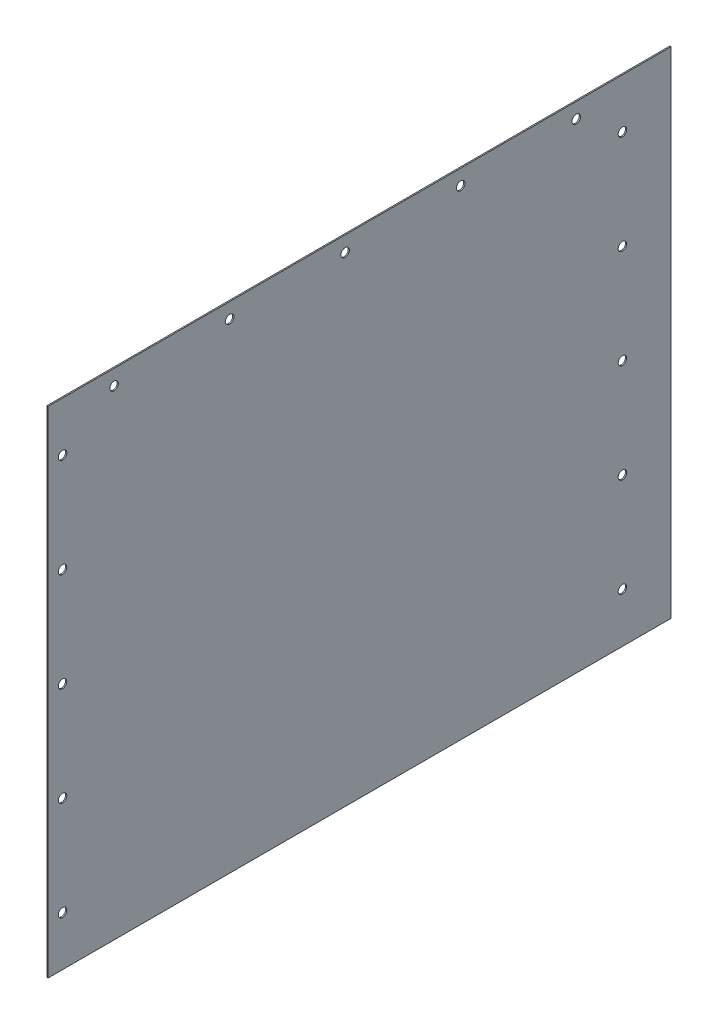
ISO-10303-21;
HEADER;
FILE_DESCRIPTION(('STEP AP214'),'2;1');
FILE_NAME('part.step','',(''),(''),'','','');
FILE_SCHEMA(('AUTOMOTIVE_DESIGN { 1 0 10303 214 1 1 1 1 }'));
ENDSEC;
DATA;
#1=APPLICATION_CONTEXT('core data for automotive mechanical design processes');
#2=APPLICATION_PROTOCOL_DEFINITION('international standard','automotive_design',2000,#1);
#3=PRODUCT_CONTEXT('',#1,'mechanical');
#4=PRODUCT('Part','Part','',(#3));
#5=PRODUCT_RELATED_PRODUCT_CATEGORY('part','',(#4));
#6=PRODUCT_DEFINITION_FORMATION('','',#4);
#7=PRODUCT_DEFINITION_CONTEXT('part definition',#1,'design');
#8=PRODUCT_DEFINITION('design','',#6,#7);
#9=PRODUCT_DEFINITION_SHAPE('','',#8);
#10=(LENGTH_UNIT() NAMED_UNIT(*) SI_UNIT(.MILLI.,.METRE.));
#11=(NAMED_UNIT(*) PLANE_ANGLE_UNIT() SI_UNIT($,.RADIAN.));
#12=(NAMED_UNIT(*) SI_UNIT($,.STERADIAN.) SOLID_ANGLE_UNIT());
#13=UNCERTAINTY_MEASURE_WITH_UNIT(LENGTH_MEASURE(1.E-05),#10,'distance_accuracy_value','');
#14=(GEOMETRIC_REPRESENTATION_CONTEXT(3) GLOBAL_UNCERTAINTY_ASSIGNED_CONTEXT((#13)) GLOBAL_UNIT_ASSIGNED_CONTEXT((#10,
#11,#12)) REPRESENTATION_CONTEXT('',''));
#15=CARTESIAN_POINT('',(0.,0.,0.));
#16=DIRECTION('',(0.,0.,1.));
#17=DIRECTION('',(1.,0.,0.));
#18=AXIS2_PLACEMENT_3D('',#15,#16,#17);
#19=CARTESIAN_POINT('',(0.9144,-190.5,-239.6998));
#20=DIRECTION('',(0.,0.,1.));
#21=DIRECTION('',(1.,0.,0.));
#22=AXIS2_PLACEMENT_3D('',#19,#20,#21);
#23=PLANE('',#22);
#24=DIRECTION('',(0.,1.,0.));
#25=VECTOR('',#24,1.);
#26=CARTESIAN_POINT('',(0.,-190.5,-239.6998));
#27=LINE('',#26,#25);
#28=CARTESIAN_POINT('',(0.,-190.5,-239.6998));
#29=VERTEX_POINT('',#28);
#30=CARTESIAN_POINT('',(0.,190.5,-239.6998));
#31=VERTEX_POINT('',#30);
#32=EDGE_CURVE('E100',#29,#31,#27,.T.);
#33=ORIENTED_EDGE('',*,*,#32,.T.);
#34=DIRECTION('',(-1.,0.,0.));
#35=VECTOR('',#34,1.);
#36=CARTESIAN_POINT('',(0.9144,190.5,-239.6998));
#37=LINE('',#36,#35);
#38=CARTESIAN_POINT('',(0.9144,190.5,-239.6998));
#39=VERTEX_POINT('',#38);
#40=EDGE_CURVE('E11',#39,#31,#37,.T.);
#41=ORIENTED_EDGE('',*,*,#40,.F.);
#42=DIRECTION('',(0.,1.,0.));
#43=VECTOR('',#42,1.);
#44=CARTESIAN_POINT('',(0.9144,-190.5,-239.6998));
#45=LINE('',#44,#43);
#46=CARTESIAN_POINT('',(0.9144,-190.5,-239.6998));
#47=VERTEX_POINT('',#46);
#48=EDGE_CURVE('E87',#47,#39,#45,.T.);
#49=ORIENTED_EDGE('',*,*,#48,.F.);
#50=DIRECTION('',(-1.,0.,0.));
#51=VECTOR('',#50,1.);
#52=CARTESIAN_POINT('',(0.9144,-190.5,-239.6998));
#53=LINE('',#52,#51);
#54=EDGE_CURVE('E96',#47,#29,#53,.T.);
#55=ORIENTED_EDGE('',*,*,#54,.T.);
#56=EDGE_LOOP('',(#33,#41,#49,#55));
#57=FACE_BOUND('',#56,.T.);
#58=ADVANCED_FACE('F34',(#57),#23,.F.);
#59=CARTESIAN_POINT('',(0.9144,190.5,239.6998));
#60=DIRECTION('',(0.,-1.,0.));
#61=DIRECTION('',(0.,0.,-1.));
#62=AXIS2_PLACEMENT_3D('',#59,#60,#61);
#63=PLANE('',#62);
#64=DIRECTION('',(0.,0.,1.));
#65=VECTOR('',#64,1.);
#66=CARTESIAN_POINT('',(0.,190.5,239.6998));
#67=LINE('',#66,#65);
#68=CARTESIAN_POINT('',(0.,190.5,239.6998));
#69=VERTEX_POINT('',#68);
#70=EDGE_CURVE('E91',#31,#69,#67,.T.);
#71=ORIENTED_EDGE('',*,*,#70,.T.);
#72=DIRECTION('',(-1.,0.,0.));
#73=VECTOR('',#72,1.);
#74=CARTESIAN_POINT('',(0.9144,190.5,239.6998));
#75=LINE('',#74,#73);
#76=CARTESIAN_POINT('',(0.9144,190.5,239.6998));
#77=VERTEX_POINT('',#76);
#78=EDGE_CURVE('E43',#77,#69,#75,.T.);
#79=ORIENTED_EDGE('',*,*,#78,.F.);
#80=DIRECTION('',(0.,0.,1.));
#81=VECTOR('',#80,1.);
#82=CARTESIAN_POINT('',(0.9144,190.5,239.6998));
#83=LINE('',#82,#81);
#84=EDGE_CURVE('E82',#39,#77,#83,.T.);
#85=ORIENTED_EDGE('',*,*,#84,.F.);
#86=ORIENTED_EDGE('',*,*,#40,.T.);
#87=EDGE_LOOP('',(#71,#79,#85,#86));
#88=FACE_BOUND('',#87,.T.);
#89=ADVANCED_FACE('F90',(#88),#63,.F.);
#90=CARTESIAN_POINT('',(0.9144,-190.5,239.6998));
#91=DIRECTION('',(0.,0.,-1.));
#92=DIRECTION('',(-1.,0.,0.));
#93=AXIS2_PLACEMENT_3D('',#90,#91,#92);
#94=PLANE('',#93);
#95=DIRECTION('',(0.,-1.,0.));
#96=VECTOR('',#95,1.);
#97=CARTESIAN_POINT('',(0.,-190.5,239.6998));
#98=LINE('',#97,#96);
#99=CARTESIAN_POINT('',(0.,-190.5,239.6998));
#100=VERTEX_POINT('',#99);
#101=EDGE_CURVE('E69',#69,#100,#98,.T.);
#102=ORIENTED_EDGE('',*,*,#101,.T.);
#103=DIRECTION('',(-1.,0.,0.));
#104=VECTOR('',#103,1.);
#105=CARTESIAN_POINT('',(0.9144,-190.5,239.6998));
#106=LINE('',#105,#104);
#107=CARTESIAN_POINT('',(0.9144,-190.5,239.6998));
#108=VERTEX_POINT('',#107);
#109=EDGE_CURVE('E92',#108,#100,#106,.T.);
#110=ORIENTED_EDGE('',*,*,#109,.F.);
#111=DIRECTION('',(0.,-1.,0.));
#112=VECTOR('',#111,1.);
#113=CARTESIAN_POINT('',(0.9144,-190.5,239.6998));
#114=LINE('',#113,#112);
#115=EDGE_CURVE('E85',#77,#108,#114,.T.);
#116=ORIENTED_EDGE('',*,*,#115,.F.);
#117=ORIENTED_EDGE('',*,*,#78,.T.);
#118=EDGE_LOOP('',(#102,#110,#116,#117));
#119=FACE_BOUND('',#118,.T.);
#120=ADVANCED_FACE('F94',(#119),#94,.F.);
#121=CARTESIAN_POINT('',(0.9144,-190.5,239.6998));
#122=DIRECTION('',(0.,1.,0.));
#123=DIRECTION('',(0.,0.,1.));
#124=AXIS2_PLACEMENT_3D('',#121,#122,#123);
#125=PLANE('',#124);
#126=DIRECTION('',(0.,0.,-1.));
#127=VECTOR('',#126,1.);
#128=CARTESIAN_POINT('',(0.,-190.5,239.6998));
#129=LINE('',#128,#127);
#130=EDGE_CURVE('E75',#100,#29,#129,.T.);
#131=ORIENTED_EDGE('',*,*,#130,.T.);
#132=ORIENTED_EDGE('',*,*,#54,.F.);
#133=DIRECTION('',(0.,0.,-1.));
#134=VECTOR('',#133,1.);
#135=CARTESIAN_POINT('',(0.9144,-190.5,239.6998));
#136=LINE('',#135,#134);
#137=EDGE_CURVE('E52',#108,#47,#136,.T.);
#138=ORIENTED_EDGE('',*,*,#137,.F.);
#139=ORIENTED_EDGE('',*,*,#109,.T.);
#140=EDGE_LOOP('',(#131,#132,#138,#139));
#141=FACE_BOUND('',#140,.T.);
#142=ADVANCED_FACE('F176',(#141),#125,.F.);
#143=CARTESIAN_POINT('',(0.9144,0.,0.));
#144=DIRECTION('',(-1.,0.,0.));
#145=DIRECTION('',(0.,0.,1.));
#146=AXIS2_PLACEMENT_3D('',#143,#144,#145);
#147=PLANE('',#146);
#148=CARTESIAN_POINT('',(0.9144,152.4,-202.2856));
#149=DIRECTION('',(-1.,0.,0.));
#150=DIRECTION('',(0.,0.,1.));
#151=AXIS2_PLACEMENT_3D('',#148,#149,#150);
#152=CIRCLE('',#151,3.26389999999998);
#153=CARTESIAN_POINT('',(0.9144,152.4,-199.0217));
#154=VERTEX_POINT('',#153);
#155=EDGE_CURVE('E365',#154,#154,#152,.T.);
#156=ORIENTED_EDGE('',*,*,#155,.T.);
#157=EDGE_LOOP('',(#156));
#158=FACE_BOUND('',#157,.T.);
#159=CARTESIAN_POINT('',(0.9144,76.2,-202.2856));
#160=DIRECTION('',(-1.,0.,0.));
#161=DIRECTION('',(0.,0.,1.));
#162=AXIS2_PLACEMENT_3D('',#159,#160,#161);
#163=CIRCLE('',#162,3.26389999999998);
#164=CARTESIAN_POINT('',(0.9144,76.2,-199.0217));
#165=VERTEX_POINT('',#164);
#166=EDGE_CURVE('E366',#165,#165,#163,.T.);
#167=ORIENTED_EDGE('',*,*,#166,.T.);
#168=EDGE_LOOP('',(#167));
#169=FACE_BOUND('',#168,.T.);
#170=CARTESIAN_POINT('',(0.9144,0.,-202.2856));
#171=DIRECTION('',(-1.,0.,0.));
#172=DIRECTION('',(0.,0.,1.));
#173=AXIS2_PLACEMENT_3D('',#170,#171,#172);
#174=CIRCLE('',#173,3.26389999999998);
#175=CARTESIAN_POINT('',(0.9144,0.,-199.0217));
#176=VERTEX_POINT('',#175);
#177=EDGE_CURVE('E371',#176,#176,#174,.T.);
#178=ORIENTED_EDGE('',*,*,#177,.T.);
#179=EDGE_LOOP('',(#178));
#180=FACE_BOUND('',#179,.T.);
#181=CARTESIAN_POINT('',(0.9144,-76.2,-202.2856));
#182=DIRECTION('',(-1.,0.,0.));
#183=DIRECTION('',(0.,0.,1.));
#184=AXIS2_PLACEMENT_3D('',#181,#182,#183);
#185=CIRCLE('',#184,3.26389999999998);
#186=CARTESIAN_POINT('',(0.9144,-76.2,-199.0217));
#187=VERTEX_POINT('',#186);
#188=EDGE_CURVE('E417',#187,#187,#185,.T.);
#189=ORIENTED_EDGE('',*,*,#188,.T.);
#190=EDGE_LOOP('',(#189));
#191=FACE_BOUND('',#190,.T.);
#192=CARTESIAN_POINT('',(0.9144,-152.4,-202.2856));
#193=DIRECTION('',(-1.,0.,0.));
#194=DIRECTION('',(0.,0.,1.));
#195=AXIS2_PLACEMENT_3D('',#192,#193,#194);
#196=CIRCLE('',#195,3.26389999999998);
#197=CARTESIAN_POINT('',(0.9144,-152.4,-199.0217));
#198=VERTEX_POINT('',#197);
#199=EDGE_CURVE('E420',#198,#198,#196,.T.);
#200=ORIENTED_EDGE('',*,*,#199,.T.);
#201=EDGE_LOOP('',(#200));
#202=FACE_BOUND('',#201,.T.);
#203=CARTESIAN_POINT('',(0.9144,152.4,228.6));
#204=DIRECTION('',(1.,0.,0.));
#205=DIRECTION('',(0.,0.,-1.));
#206=AXIS2_PLACEMENT_3D('',#203,#204,#205);
#207=CIRCLE('',#206,3.26390000000001);
#208=CARTESIAN_POINT('',(0.9144,152.4,225.3361));
#209=VERTEX_POINT('',#208);
#210=EDGE_CURVE('E113',#209,#209,#207,.T.);
#211=ORIENTED_EDGE('',*,*,#210,.F.);
#212=EDGE_LOOP('',(#211));
#213=FACE_BOUND('',#212,.T.);
#214=CARTESIAN_POINT('',(0.9144,76.2,228.6));
#215=DIRECTION('',(1.,0.,0.));
#216=DIRECTION('',(0.,0.,-1.));
#217=AXIS2_PLACEMENT_3D('',#214,#215,#216);
#218=CIRCLE('',#217,3.26390000000001);
#219=CARTESIAN_POINT('',(0.9144,76.2,225.3361));
#220=VERTEX_POINT('',#219);
#221=EDGE_CURVE('E377',#220,#220,#218,.T.);
#222=ORIENTED_EDGE('',*,*,#221,.F.);
#223=EDGE_LOOP('',(#222));
#224=FACE_BOUND('',#223,.T.);
#225=CARTESIAN_POINT('',(0.9144,0.,228.6));
#226=DIRECTION('',(1.,0.,0.));
#227=DIRECTION('',(0.,0.,-1.));
#228=AXIS2_PLACEMENT_3D('',#225,#226,#227);
#229=CIRCLE('',#228,3.26390000000001);
#230=CARTESIAN_POINT('',(0.9144,0.,225.3361));
#231=VERTEX_POINT('',#230);
#232=EDGE_CURVE('E380',#231,#231,#229,.T.);
#233=ORIENTED_EDGE('',*,*,#232,.F.);
#234=EDGE_LOOP('',(#233));
#235=FACE_BOUND('',#234,.T.);
#236=CARTESIAN_POINT('',(0.9144,-76.2,228.6));
#237=DIRECTION('',(1.,0.,0.));
#238=DIRECTION('',(0.,0.,-1.));
#239=AXIS2_PLACEMENT_3D('',#236,#237,#238);
#240=CIRCLE('',#239,3.26390000000001);
#241=CARTESIAN_POINT('',(0.9144,-76.2,225.3361));
#242=VERTEX_POINT('',#241);
#243=EDGE_CURVE('E369',#242,#242,#240,.T.);
#244=ORIENTED_EDGE('',*,*,#243,.F.);
#245=EDGE_LOOP('',(#244));
#246=FACE_BOUND('',#245,.T.);
#247=CARTESIAN_POINT('',(0.9144,-152.4,228.6));
#248=DIRECTION('',(1.,0.,0.));
#249=DIRECTION('',(0.,0.,-1.));
#250=AXIS2_PLACEMENT_3D('',#247,#248,#249);
#251=CIRCLE('',#250,3.26390000000001);
#252=CARTESIAN_POINT('',(0.9144,-152.4,225.3361));
#253=VERTEX_POINT('',#252);
#254=EDGE_CURVE('E135',#253,#253,#251,.T.);
#255=ORIENTED_EDGE('',*,*,#254,.F.);
#256=EDGE_LOOP('',(#255));
#257=FACE_BOUND('',#256,.T.);
#258=CARTESIAN_POINT('',(0.914399999999999,178.714400000005,188.899800000009));
#259=DIRECTION('',(-1.,0.,0.));
#260=DIRECTION('',(0.,0.,1.));
#261=AXIS2_PLACEMENT_3D('',#258,#259,#260);
#262=CIRCLE('',#261,3.26389999999999);
#263=CARTESIAN_POINT('',(0.914399999999999,178.714400000005,192.163700000009));
#264=VERTEX_POINT('',#263);
#265=EDGE_CURVE('E127',#264,#264,#262,.T.);
#266=ORIENTED_EDGE('',*,*,#265,.T.);
#267=EDGE_LOOP('',(#266));
#268=FACE_BOUND('',#267,.T.);
#269=CARTESIAN_POINT('',(0.914399999999999,178.7144,99.9998000000064));
#270=DIRECTION('',(-1.,0.,0.));
#271=DIRECTION('',(0.,0.,1.));
#272=AXIS2_PLACEMENT_3D('',#269,#270,#271);
#273=CIRCLE('',#272,3.26389999999999);
#274=CARTESIAN_POINT('',(0.914399999999999,178.7144,103.263700000006));
#275=VERTEX_POINT('',#274);
#276=EDGE_CURVE('E140',#275,#275,#273,.T.);
#277=ORIENTED_EDGE('',*,*,#276,.T.);
#278=EDGE_LOOP('',(#277));
#279=FACE_BOUND('',#278,.T.);
#280=CARTESIAN_POINT('',(0.914399999999999,178.714400000003,11.0998000000064));
#281=DIRECTION('',(-1.,0.,0.));
#282=DIRECTION('',(0.,0.,1.));
#283=AXIS2_PLACEMENT_3D('',#280,#281,#282);
#284=CIRCLE('',#283,3.26390000000001);
#285=CARTESIAN_POINT('',(0.914399999999999,178.714400000003,14.3637000000064));
#286=VERTEX_POINT('',#285);
#287=EDGE_CURVE('E146',#286,#286,#284,.T.);
#288=ORIENTED_EDGE('',*,*,#287,.T.);
#289=EDGE_LOOP('',(#288));
#290=FACE_BOUND('',#289,.T.);
#291=CARTESIAN_POINT('',(0.914399999999999,178.714400000003,-77.8001999999936));
#292=DIRECTION('',(-1.,0.,0.));
#293=DIRECTION('',(0.,0.,1.));
#294=AXIS2_PLACEMENT_3D('',#291,#292,#293);
#295=CIRCLE('',#294,3.26390000000001);
#296=CARTESIAN_POINT('',(0.914399999999999,178.714400000003,-74.5362999999936));
#297=VERTEX_POINT('',#296);
#298=EDGE_CURVE('E152',#297,#297,#295,.T.);
#299=ORIENTED_EDGE('',*,*,#298,.T.);
#300=EDGE_LOOP('',(#299));
#301=FACE_BOUND('',#300,.T.);
#302=CARTESIAN_POINT('',(0.914399999999999,178.714400000003,-166.700199999994));
#303=DIRECTION('',(-1.,0.,0.));
#304=DIRECTION('',(0.,0.,1.));
#305=AXIS2_PLACEMENT_3D('',#302,#303,#304);
#306=CIRCLE('',#305,3.26390000000001);
#307=CARTESIAN_POINT('',(0.914399999999999,178.714400000003,-163.436299999994));
#308=VERTEX_POINT('',#307);
#309=EDGE_CURVE('E103',#308,#308,#306,.T.);
#310=ORIENTED_EDGE('',*,*,#309,.T.);
#311=EDGE_LOOP('',(#310));
#312=FACE_BOUND('',#311,.T.);
#313=ORIENTED_EDGE('',*,*,#48,.T.);
#314=ORIENTED_EDGE('',*,*,#84,.T.);
#315=ORIENTED_EDGE('',*,*,#115,.T.);
#316=ORIENTED_EDGE('',*,*,#137,.T.);
#317=EDGE_LOOP('',(#313,#314,#315,#316));
#318=FACE_BOUND('',#317,.T.);
#319=ADVANCED_FACE('F83',(#158,#169,#180,#191,#202,#213,#224,#235,#246,#257,#268,#279,#290,#301,
#312,#318),#147,.F.);
#320=CARTESIAN_POINT('',(0.,0.,0.));
#321=DIRECTION('',(-1.,0.,0.));
#322=DIRECTION('',(0.,0.,1.));
#323=AXIS2_PLACEMENT_3D('',#320,#321,#322);
#324=PLANE('',#323);
#325=CARTESIAN_POINT('',(0.,152.4,-202.2856));
#326=DIRECTION('',(-1.,0.,0.));
#327=DIRECTION('',(0.,0.,1.));
#328=AXIS2_PLACEMENT_3D('',#325,#326,#327);
#329=CIRCLE('',#328,3.26389999999998);
#330=CARTESIAN_POINT('',(0.,152.4,-199.0217));
#331=VERTEX_POINT('',#330);
#332=EDGE_CURVE('E362',#331,#331,#329,.T.);
#333=ORIENTED_EDGE('',*,*,#332,.F.);
#334=EDGE_LOOP('',(#333));
#335=FACE_BOUND('',#334,.T.);
#336=CARTESIAN_POINT('',(0.,76.2,-202.2856));
#337=DIRECTION('',(-1.,0.,0.));
#338=DIRECTION('',(0.,0.,1.));
#339=AXIS2_PLACEMENT_3D('',#336,#337,#338);
#340=CIRCLE('',#339,3.26389999999998);
#341=CARTESIAN_POINT('',(0.,76.2,-199.0217));
#342=VERTEX_POINT('',#341);
#343=EDGE_CURVE('E432',#342,#342,#340,.T.);
#344=ORIENTED_EDGE('',*,*,#343,.F.);
#345=EDGE_LOOP('',(#344));
#346=FACE_BOUND('',#345,.T.);
#347=CARTESIAN_POINT('',(0.,0.,-202.2856));
#348=DIRECTION('',(-1.,0.,0.));
#349=DIRECTION('',(0.,0.,1.));
#350=AXIS2_PLACEMENT_3D('',#347,#348,#349);
#351=CIRCLE('',#350,3.26389999999998);
#352=CARTESIAN_POINT('',(0.,0.,-199.0217));
#353=VERTEX_POINT('',#352);
#354=EDGE_CURVE('E429',#353,#353,#351,.T.);
#355=ORIENTED_EDGE('',*,*,#354,.F.);
#356=EDGE_LOOP('',(#355));
#357=FACE_BOUND('',#356,.T.);
#358=CARTESIAN_POINT('',(0.,-76.2,-202.2856));
#359=DIRECTION('',(-1.,0.,0.));
#360=DIRECTION('',(0.,0.,1.));
#361=AXIS2_PLACEMENT_3D('',#358,#359,#360);
#362=CIRCLE('',#361,3.26389999999998);
#363=CARTESIAN_POINT('',(0.,-76.2,-199.0217));
#364=VERTEX_POINT('',#363);
#365=EDGE_CURVE('E426',#364,#364,#362,.T.);
#366=ORIENTED_EDGE('',*,*,#365,.F.);
#367=EDGE_LOOP('',(#366));
#368=FACE_BOUND('',#367,.T.);
#369=CARTESIAN_POINT('',(0.,-152.4,-202.2856));
#370=DIRECTION('',(-1.,0.,0.));
#371=DIRECTION('',(0.,0.,1.));
#372=AXIS2_PLACEMENT_3D('',#369,#370,#371);
#373=CIRCLE('',#372,3.26389999999998);
#374=CARTESIAN_POINT('',(0.,-152.4,-199.0217));
#375=VERTEX_POINT('',#374);
#376=EDGE_CURVE('E423',#375,#375,#373,.T.);
#377=ORIENTED_EDGE('',*,*,#376,.F.);
#378=EDGE_LOOP('',(#377));
#379=FACE_BOUND('',#378,.T.);
#380=CARTESIAN_POINT('',(0.,152.4,228.6));
#381=DIRECTION('',(-1.,0.,0.));
#382=DIRECTION('',(0.,0.,1.));
#383=AXIS2_PLACEMENT_3D('',#380,#381,#382);
#384=CIRCLE('',#383,3.26390000000001);
#385=CARTESIAN_POINT('',(0.,152.4,231.8639));
#386=VERTEX_POINT('',#385);
#387=EDGE_CURVE('E37',#386,#386,#384,.T.);
#388=ORIENTED_EDGE('',*,*,#387,.F.);
#389=EDGE_LOOP('',(#388));
#390=FACE_BOUND('',#389,.T.);
#391=CARTESIAN_POINT('',(0.,76.2,228.6));
#392=DIRECTION('',(-1.,0.,0.));
#393=DIRECTION('',(0.,0.,1.));
#394=AXIS2_PLACEMENT_3D('',#391,#392,#393);
#395=CIRCLE('',#394,3.26390000000001);
#396=CARTESIAN_POINT('',(0.,76.2,231.8639));
#397=VERTEX_POINT('',#396);
#398=EDGE_CURVE('E118',#397,#397,#395,.T.);
#399=ORIENTED_EDGE('',*,*,#398,.F.);
#400=EDGE_LOOP('',(#399));
#401=FACE_BOUND('',#400,.T.);
#402=CARTESIAN_POINT('',(0.,0.,228.6));
#403=DIRECTION('',(-1.,0.,0.));
#404=DIRECTION('',(0.,0.,1.));
#405=AXIS2_PLACEMENT_3D('',#402,#403,#404);
#406=CIRCLE('',#405,3.26390000000001);
#407=CARTESIAN_POINT('',(0.,0.,231.8639));
#408=VERTEX_POINT('',#407);
#409=EDGE_CURVE('E116',#408,#408,#406,.T.);
#410=ORIENTED_EDGE('',*,*,#409,.F.);
#411=EDGE_LOOP('',(#410));
#412=FACE_BOUND('',#411,.T.);
#413=CARTESIAN_POINT('',(0.,-76.2,228.6));
#414=DIRECTION('',(-1.,0.,0.));
#415=DIRECTION('',(0.,0.,1.));
#416=AXIS2_PLACEMENT_3D('',#413,#414,#415);
#417=CIRCLE('',#416,3.26390000000001);
#418=CARTESIAN_POINT('',(0.,-76.2,231.8639));
#419=VERTEX_POINT('',#418);
#420=EDGE_CURVE('E112',#419,#419,#417,.T.);
#421=ORIENTED_EDGE('',*,*,#420,.F.);
#422=EDGE_LOOP('',(#421));
#423=FACE_BOUND('',#422,.T.);
#424=CARTESIAN_POINT('',(0.,-152.4,228.6));
#425=DIRECTION('',(-1.,0.,0.));
#426=DIRECTION('',(0.,0.,1.));
#427=AXIS2_PLACEMENT_3D('',#424,#425,#426);
#428=CIRCLE('',#427,3.26390000000001);
#429=CARTESIAN_POINT('',(0.,-152.4,231.8639));
#430=VERTEX_POINT('',#429);
#431=EDGE_CURVE('E109',#430,#430,#428,.T.);
#432=ORIENTED_EDGE('',*,*,#431,.F.);
#433=EDGE_LOOP('',(#432));
#434=FACE_BOUND('',#433,.T.);
#435=CARTESIAN_POINT('',(0.,178.714400000005,188.899800000009));
#436=DIRECTION('',(-1.,0.,0.));
#437=DIRECTION('',(0.,0.,1.));
#438=AXIS2_PLACEMENT_3D('',#435,#436,#437);
#439=CIRCLE('',#438,3.26389999999999);
#440=CARTESIAN_POINT('',(0.,178.714400000005,192.163700000009));
#441=VERTEX_POINT('',#440);
#442=EDGE_CURVE('E123',#441,#441,#439,.T.);
#443=ORIENTED_EDGE('',*,*,#442,.F.);
#444=EDGE_LOOP('',(#443));
#445=FACE_BOUND('',#444,.T.);
#446=CARTESIAN_POINT('',(0.,178.7144,99.9998000000064));
#447=DIRECTION('',(-1.,0.,0.));
#448=DIRECTION('',(0.,0.,1.));
#449=AXIS2_PLACEMENT_3D('',#446,#447,#448);
#450=CIRCLE('',#449,3.26389999999999);
#451=CARTESIAN_POINT('',(0.,178.7144,103.263700000006));
#452=VERTEX_POINT('',#451);
#453=EDGE_CURVE('E132',#452,#452,#450,.T.);
#454=ORIENTED_EDGE('',*,*,#453,.F.);
#455=EDGE_LOOP('',(#454));
#456=FACE_BOUND('',#455,.T.);
#457=CARTESIAN_POINT('',(0.,178.714400000003,11.0998000000064));
#458=DIRECTION('',(-1.,0.,0.));
#459=DIRECTION('',(0.,0.,1.));
#460=AXIS2_PLACEMENT_3D('',#457,#458,#459);
#461=CIRCLE('',#460,3.26390000000001);
#462=CARTESIAN_POINT('',(0.,178.714400000003,14.3637000000064));
#463=VERTEX_POINT('',#462);
#464=EDGE_CURVE('E143',#463,#463,#461,.T.);
#465=ORIENTED_EDGE('',*,*,#464,.F.);
#466=EDGE_LOOP('',(#465));
#467=FACE_BOUND('',#466,.T.);
#468=CARTESIAN_POINT('',(0.,178.714400000003,-77.8001999999936));
#469=DIRECTION('',(-1.,0.,0.));
#470=DIRECTION('',(0.,0.,1.));
#471=AXIS2_PLACEMENT_3D('',#468,#469,#470);
#472=CIRCLE('',#471,3.26390000000001);
#473=CARTESIAN_POINT('',(0.,178.714400000003,-74.5362999999936));
#474=VERTEX_POINT('',#473);
#475=EDGE_CURVE('E149',#474,#474,#472,.T.);
#476=ORIENTED_EDGE('',*,*,#475,.F.);
#477=EDGE_LOOP('',(#476));
#478=FACE_BOUND('',#477,.T.);
#479=CARTESIAN_POINT('',(0.,178.714400000003,-166.700199999994));
#480=DIRECTION('',(-1.,0.,0.));
#481=DIRECTION('',(0.,0.,1.));
#482=AXIS2_PLACEMENT_3D('',#479,#480,#481);
#483=CIRCLE('',#482,3.26390000000001);
#484=CARTESIAN_POINT('',(0.,178.714400000003,-163.436299999994));
#485=VERTEX_POINT('',#484);
#486=EDGE_CURVE('E155',#485,#485,#483,.T.);
#487=ORIENTED_EDGE('',*,*,#486,.F.);
#488=EDGE_LOOP('',(#487));
#489=FACE_BOUND('',#488,.T.);
#490=ORIENTED_EDGE('',*,*,#32,.F.);
#491=ORIENTED_EDGE('',*,*,#130,.F.);
#492=ORIENTED_EDGE('',*,*,#101,.F.);
#493=ORIENTED_EDGE('',*,*,#70,.F.);
#494=EDGE_LOOP('',(#490,#491,#492,#493));
#495=FACE_BOUND('',#494,.T.);
#496=ADVANCED_FACE('F166',(#335,#346,#357,#368,#379,#390,#401,#412,#423,#434,#445,#456,#467,
#478,#489,#495),#324,.T.);
#497=CARTESIAN_POINT('',(0.,178.714400000003,-166.700199999994));
#498=DIRECTION('',(-1.,0.,0.));
#499=DIRECTION('',(0.,0.,1.));
#500=AXIS2_PLACEMENT_3D('',#497,#498,#499);
#501=CYLINDRICAL_SURFACE('',#500,3.26390000000001);
#502=ORIENTED_EDGE('',*,*,#309,.F.);
#503=EDGE_LOOP('',(#502));
#504=FACE_BOUND('',#503,.T.);
#505=ORIENTED_EDGE('',*,*,#486,.T.);
#506=EDGE_LOOP('',(#505));
#507=FACE_BOUND('',#506,.T.);
#508=ADVANCED_FACE('F162',(#504,#507),#501,.F.);
#509=CARTESIAN_POINT('',(0.,178.714400000003,-77.8001999999936));
#510=DIRECTION('',(-1.,0.,0.));
#511=DIRECTION('',(0.,0.,1.));
#512=AXIS2_PLACEMENT_3D('',#509,#510,#511);
#513=CYLINDRICAL_SURFACE('',#512,3.26390000000001);
#514=ORIENTED_EDGE('',*,*,#298,.F.);
#515=EDGE_LOOP('',(#514));
#516=FACE_BOUND('',#515,.T.);
#517=ORIENTED_EDGE('',*,*,#475,.T.);
#518=EDGE_LOOP('',(#517));
#519=FACE_BOUND('',#518,.T.);
#520=ADVANCED_FACE('F165',(#516,#519),#513,.F.);
#521=CARTESIAN_POINT('',(0.,178.714400000003,11.0998000000064));
#522=DIRECTION('',(-1.,0.,0.));
#523=DIRECTION('',(0.,0.,1.));
#524=AXIS2_PLACEMENT_3D('',#521,#522,#523);
#525=CYLINDRICAL_SURFACE('',#524,3.26390000000001);
#526=ORIENTED_EDGE('',*,*,#287,.F.);
#527=EDGE_LOOP('',(#526));
#528=FACE_BOUND('',#527,.T.);
#529=ORIENTED_EDGE('',*,*,#464,.T.);
#530=EDGE_LOOP('',(#529));
#531=FACE_BOUND('',#530,.T.);
#532=ADVANCED_FACE('F217',(#528,#531),#525,.F.);
#533=CARTESIAN_POINT('',(0.,178.7144,99.9998000000064));
#534=DIRECTION('',(-1.,0.,0.));
#535=DIRECTION('',(0.,0.,1.));
#536=AXIS2_PLACEMENT_3D('',#533,#534,#535);
#537=CYLINDRICAL_SURFACE('',#536,3.26389999999999);
#538=ORIENTED_EDGE('',*,*,#276,.F.);
#539=EDGE_LOOP('',(#538));
#540=FACE_BOUND('',#539,.T.);
#541=ORIENTED_EDGE('',*,*,#453,.T.);
#542=EDGE_LOOP('',(#541));
#543=FACE_BOUND('',#542,.T.);
#544=ADVANCED_FACE('F227',(#540,#543),#537,.F.);
#545=CARTESIAN_POINT('',(0.,178.714400000005,188.899800000009));
#546=DIRECTION('',(-1.,0.,0.));
#547=DIRECTION('',(0.,0.,1.));
#548=AXIS2_PLACEMENT_3D('',#545,#546,#547);
#549=CYLINDRICAL_SURFACE('',#548,3.26389999999999);
#550=ORIENTED_EDGE('',*,*,#265,.F.);
#551=EDGE_LOOP('',(#550));
#552=FACE_BOUND('',#551,.T.);
#553=ORIENTED_EDGE('',*,*,#442,.T.);
#554=EDGE_LOOP('',(#553));
#555=FACE_BOUND('',#554,.T.);
#556=ADVANCED_FACE('F237',(#552,#555),#549,.F.);
#557=CARTESIAN_POINT('',(-1.6256,-152.4,228.6));
#558=DIRECTION('',(1.,0.,0.));
#559=DIRECTION('',(0.,0.,-1.));
#560=AXIS2_PLACEMENT_3D('',#557,#558,#559);
#561=CYLINDRICAL_SURFACE('',#560,3.26390000000001);
#562=ORIENTED_EDGE('',*,*,#431,.T.);
#563=EDGE_LOOP('',(#562));
#564=FACE_BOUND('',#563,.T.);
#565=ORIENTED_EDGE('',*,*,#254,.T.);
#566=EDGE_LOOP('',(#565));
#567=FACE_BOUND('',#566,.T.);
#568=ADVANCED_FACE('F247',(#564,#567),#561,.F.);
#569=CARTESIAN_POINT('',(-1.6256,-76.2,228.6));
#570=DIRECTION('',(1.,0.,0.));
#571=DIRECTION('',(0.,0.,-1.));
#572=AXIS2_PLACEMENT_3D('',#569,#570,#571);
#573=CYLINDRICAL_SURFACE('',#572,3.26390000000001);
#574=ORIENTED_EDGE('',*,*,#420,.T.);
#575=EDGE_LOOP('',(#574));
#576=FACE_BOUND('',#575,.T.);
#577=ORIENTED_EDGE('',*,*,#243,.T.);
#578=EDGE_LOOP('',(#577));
#579=FACE_BOUND('',#578,.T.);
#580=ADVANCED_FACE('F257',(#576,#579),#573,.F.);
#581=CARTESIAN_POINT('',(-1.6256,0.,228.6));
#582=DIRECTION('',(1.,0.,0.));
#583=DIRECTION('',(0.,0.,-1.));
#584=AXIS2_PLACEMENT_3D('',#581,#582,#583);
#585=CYLINDRICAL_SURFACE('',#584,3.26390000000001);
#586=ORIENTED_EDGE('',*,*,#409,.T.);
#587=EDGE_LOOP('',(#586));
#588=FACE_BOUND('',#587,.T.);
#589=ORIENTED_EDGE('',*,*,#232,.T.);
#590=EDGE_LOOP('',(#589));
#591=FACE_BOUND('',#590,.T.);
#592=ADVANCED_FACE('F267',(#588,#591),#585,.F.);
#593=CARTESIAN_POINT('',(-1.6256,76.2,228.6));
#594=DIRECTION('',(1.,0.,0.));
#595=DIRECTION('',(0.,0.,-1.));
#596=AXIS2_PLACEMENT_3D('',#593,#594,#595);
#597=CYLINDRICAL_SURFACE('',#596,3.26390000000001);
#598=ORIENTED_EDGE('',*,*,#398,.T.);
#599=EDGE_LOOP('',(#598));
#600=FACE_BOUND('',#599,.T.);
#601=ORIENTED_EDGE('',*,*,#221,.T.);
#602=EDGE_LOOP('',(#601));
#603=FACE_BOUND('',#602,.T.);
#604=ADVANCED_FACE('F277',(#600,#603),#597,.F.);
#605=CARTESIAN_POINT('',(-1.6256,152.4,228.6));
#606=DIRECTION('',(1.,0.,0.));
#607=DIRECTION('',(0.,0.,-1.));
#608=AXIS2_PLACEMENT_3D('',#605,#606,#607);
#609=CYLINDRICAL_SURFACE('',#608,3.26390000000001);
#610=ORIENTED_EDGE('',*,*,#387,.T.);
#611=EDGE_LOOP('',(#610));
#612=FACE_BOUND('',#611,.T.);
#613=ORIENTED_EDGE('',*,*,#210,.T.);
#614=EDGE_LOOP('',(#613));
#615=FACE_BOUND('',#614,.T.);
#616=ADVANCED_FACE('F287',(#612,#615),#609,.F.);
#617=CARTESIAN_POINT('',(2.54,-152.4,-202.2856));
#618=DIRECTION('',(-1.,0.,0.));
#619=DIRECTION('',(0.,0.,1.));
#620=AXIS2_PLACEMENT_3D('',#617,#618,#619);
#621=CYLINDRICAL_SURFACE('',#620,3.26389999999998);
#622=ORIENTED_EDGE('',*,*,#376,.T.);
#623=EDGE_LOOP('',(#622));
#624=FACE_BOUND('',#623,.T.);
#625=ORIENTED_EDGE('',*,*,#199,.F.);
#626=EDGE_LOOP('',(#625));
#627=FACE_BOUND('',#626,.T.);
#628=ADVANCED_FACE('F296',(#624,#627),#621,.F.);
#629=CARTESIAN_POINT('',(2.54,-76.2,-202.2856));
#630=DIRECTION('',(-1.,0.,0.));
#631=DIRECTION('',(0.,0.,1.));
#632=AXIS2_PLACEMENT_3D('',#629,#630,#631);
#633=CYLINDRICAL_SURFACE('',#632,3.26389999999998);
#634=ORIENTED_EDGE('',*,*,#365,.T.);
#635=EDGE_LOOP('',(#634));
#636=FACE_BOUND('',#635,.T.);
#637=ORIENTED_EDGE('',*,*,#188,.F.);
#638=EDGE_LOOP('',(#637));
#639=FACE_BOUND('',#638,.T.);
#640=ADVANCED_FACE('F315',(#636,#639),#633,.F.);
#641=CARTESIAN_POINT('',(2.54,0.,-202.2856));
#642=DIRECTION('',(-1.,0.,0.));
#643=DIRECTION('',(0.,0.,1.));
#644=AXIS2_PLACEMENT_3D('',#641,#642,#643);
#645=CYLINDRICAL_SURFACE('',#644,3.26389999999998);
#646=ORIENTED_EDGE('',*,*,#354,.T.);
#647=EDGE_LOOP('',(#646));
#648=FACE_BOUND('',#647,.T.);
#649=ORIENTED_EDGE('',*,*,#177,.F.);
#650=EDGE_LOOP('',(#649));
#651=FACE_BOUND('',#650,.T.);
#652=ADVANCED_FACE('F325',(#648,#651),#645,.F.);
#653=CARTESIAN_POINT('',(2.54,76.2,-202.2856));
#654=DIRECTION('',(-1.,0.,0.));
#655=DIRECTION('',(0.,0.,1.));
#656=AXIS2_PLACEMENT_3D('',#653,#654,#655);
#657=CYLINDRICAL_SURFACE('',#656,3.26389999999998);
#658=ORIENTED_EDGE('',*,*,#343,.T.);
#659=EDGE_LOOP('',(#658));
#660=FACE_BOUND('',#659,.T.);
#661=ORIENTED_EDGE('',*,*,#166,.F.);
#662=EDGE_LOOP('',(#661));
#663=FACE_BOUND('',#662,.T.);
#664=ADVANCED_FACE('F335',(#660,#663),#657,.F.);
#665=CARTESIAN_POINT('',(2.54,152.4,-202.2856));
#666=DIRECTION('',(-1.,0.,0.));
#667=DIRECTION('',(0.,0.,1.));
#668=AXIS2_PLACEMENT_3D('',#665,#666,#667);
#669=CYLINDRICAL_SURFACE('',#668,3.26389999999998);
#670=ORIENTED_EDGE('',*,*,#332,.T.);
#671=EDGE_LOOP('',(#670));
#672=FACE_BOUND('',#671,.T.);
#673=ORIENTED_EDGE('',*,*,#155,.F.);
#674=EDGE_LOOP('',(#673));
#675=FACE_BOUND('',#674,.T.);
#676=ADVANCED_FACE('F345',(#672,#675),#669,.F.);
#677=CLOSED_SHELL('',(#58,#89,#120,#142,#319,#496,#508,#520,#532,#544,#556,#568,#580,#592,#604,
#616,#628,#640,#652,#664,#676));
#678=MANIFOLD_SOLID_BREP('B2',#677);
#679=ADVANCED_BREP_SHAPE_REPRESENTATION('',(#18,#678),#14);
#680=SHAPE_DEFINITION_REPRESENTATION(#9,#679);
ENDSEC;
END-ISO-10303-21;
